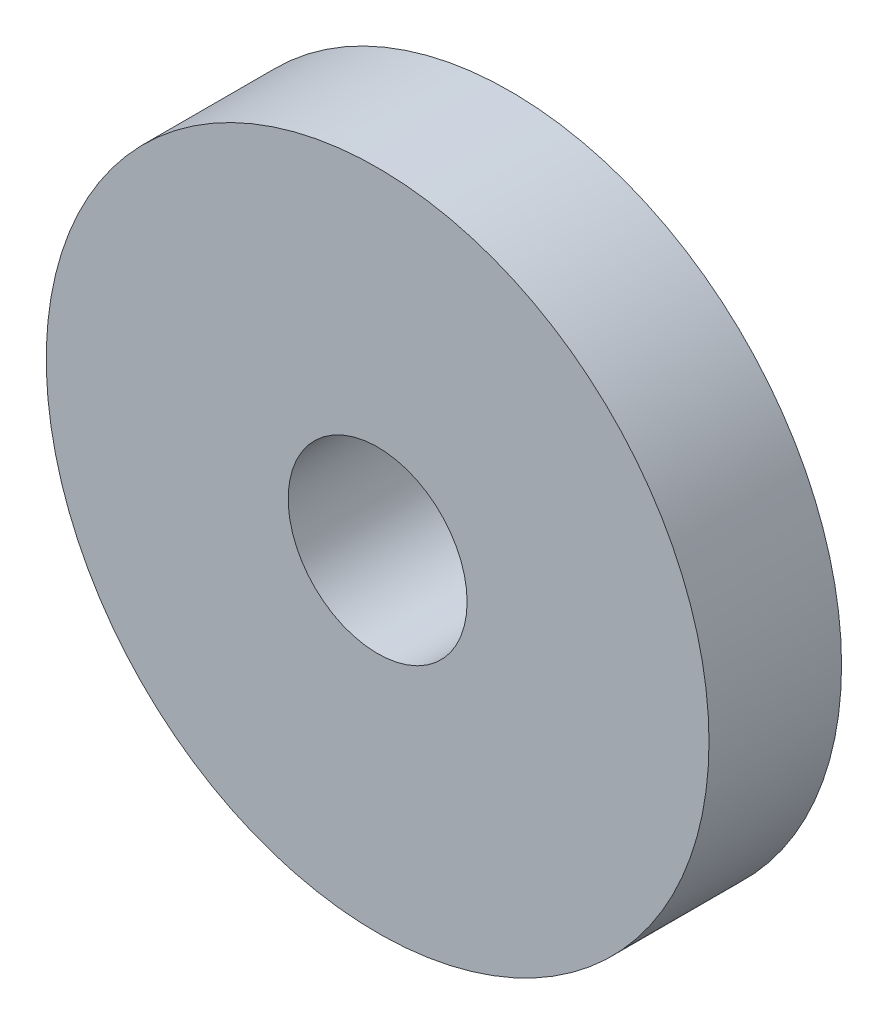
ISO-10303-21;
HEADER;
FILE_DESCRIPTION(('STEP AP214'),'2;1');
FILE_NAME('part.step','',(''),(''),'','','');
FILE_SCHEMA(('AUTOMOTIVE_DESIGN { 1 0 10303 214 1 1 1 1 }'));
ENDSEC;
DATA;
#1=APPLICATION_CONTEXT('core data for automotive mechanical design processes');
#2=APPLICATION_PROTOCOL_DEFINITION('international standard','automotive_design',2000,#1);
#3=PRODUCT_CONTEXT('',#1,'mechanical');
#4=PRODUCT('Part','Part','',(#3));
#5=PRODUCT_RELATED_PRODUCT_CATEGORY('part','',(#4));
#6=PRODUCT_DEFINITION_FORMATION('','',#4);
#7=PRODUCT_DEFINITION_CONTEXT('part definition',#1,'design');
#8=PRODUCT_DEFINITION('design','',#6,#7);
#9=PRODUCT_DEFINITION_SHAPE('','',#8);
#10=(LENGTH_UNIT() NAMED_UNIT(*) SI_UNIT(.MILLI.,.METRE.));
#11=(NAMED_UNIT(*) PLANE_ANGLE_UNIT() SI_UNIT($,.RADIAN.));
#12=(NAMED_UNIT(*) SI_UNIT($,.STERADIAN.) SOLID_ANGLE_UNIT());
#13=UNCERTAINTY_MEASURE_WITH_UNIT(LENGTH_MEASURE(1.E-05),#10,'distance_accuracy_value','');
#14=(GEOMETRIC_REPRESENTATION_CONTEXT(3) GLOBAL_UNCERTAINTY_ASSIGNED_CONTEXT((#13)) GLOBAL_UNIT_ASSIGNED_CONTEXT((#10,
#11,#12)) REPRESENTATION_CONTEXT('',''));
#15=CARTESIAN_POINT('',(0.,0.,0.));
#16=DIRECTION('',(0.,0.,1.));
#17=DIRECTION('',(1.,0.,0.));
#18=AXIS2_PLACEMENT_3D('',#15,#16,#17);
#19=CARTESIAN_POINT('',(0.,0.,2.));
#20=DIRECTION('',(0.,0.,1.));
#21=DIRECTION('',(1.,0.,0.));
#22=AXIS2_PLACEMENT_3D('',#19,#20,#21);
#23=PLANE('',#22);
#24=CARTESIAN_POINT('',(0.,0.,2.));
#25=DIRECTION('',(0.,0.,1.));
#26=DIRECTION('',(1.,0.,0.));
#27=AXIS2_PLACEMENT_3D('',#24,#25,#26);
#28=CIRCLE('',#27,4.99999999999989);
#29=CARTESIAN_POINT('',(4.99999999999989,0.,2.));
#30=VERTEX_POINT('',#29);
#31=EDGE_CURVE('E10',#30,#30,#28,.T.);
#32=ORIENTED_EDGE('',*,*,#31,.T.);
#33=EDGE_LOOP('',(#32));
#34=FACE_BOUND('',#33,.T.);
#35=CARTESIAN_POINT('',(0.,0.,2.));
#36=DIRECTION('',(0.,0.,1.));
#37=DIRECTION('',(1.,0.,0.));
#38=AXIS2_PLACEMENT_3D('',#35,#36,#37);
#39=CIRCLE('',#38,1.35);
#40=CARTESIAN_POINT('',(1.35,0.,2.));
#41=VERTEX_POINT('',#40);
#42=EDGE_CURVE('E41',#41,#41,#39,.T.);
#43=ORIENTED_EDGE('',*,*,#42,.F.);
#44=EDGE_LOOP('',(#43));
#45=FACE_BOUND('',#44,.T.);
#46=ADVANCED_FACE('F30',(#34,#45),#23,.T.);
#47=CARTESIAN_POINT('',(0.,0.,0.));
#48=DIRECTION('',(0.,0.,1.));
#49=DIRECTION('',(1.,0.,0.));
#50=AXIS2_PLACEMENT_3D('',#47,#48,#49);
#51=PLANE('',#50);
#52=CARTESIAN_POINT('',(0.,0.,0.));
#53=DIRECTION('',(0.,0.,1.));
#54=DIRECTION('',(1.,0.,0.));
#55=AXIS2_PLACEMENT_3D('',#52,#53,#54);
#56=CIRCLE('',#55,4.99999999999989);
#57=CARTESIAN_POINT('',(4.99999999999989,0.,0.));
#58=VERTEX_POINT('',#57);
#59=EDGE_CURVE('E34',#58,#58,#56,.T.);
#60=ORIENTED_EDGE('',*,*,#59,.F.);
#61=EDGE_LOOP('',(#60));
#62=FACE_BOUND('',#61,.T.);
#63=CARTESIAN_POINT('',(0.,0.,0.));
#64=DIRECTION('',(0.,0.,1.));
#65=DIRECTION('',(1.,0.,0.));
#66=AXIS2_PLACEMENT_3D('',#63,#64,#65);
#67=CIRCLE('',#66,1.35);
#68=CARTESIAN_POINT('',(1.35,0.,0.));
#69=VERTEX_POINT('',#68);
#70=EDGE_CURVE('E43',#69,#69,#67,.T.);
#71=ORIENTED_EDGE('',*,*,#70,.T.);
#72=EDGE_LOOP('',(#71));
#73=FACE_BOUND('',#72,.T.);
#74=ADVANCED_FACE('F53',(#62,#73),#51,.F.);
#75=CARTESIAN_POINT('',(0.,0.,2.));
#76=DIRECTION('',(0.,0.,-1.));
#77=DIRECTION('',(-1.,0.,0.));
#78=AXIS2_PLACEMENT_3D('',#75,#76,#77);
#79=CYLINDRICAL_SURFACE('',#78,4.99999999999989);
#80=ORIENTED_EDGE('',*,*,#31,.F.);
#81=EDGE_LOOP('',(#80));
#82=FACE_BOUND('',#81,.T.);
#83=ORIENTED_EDGE('',*,*,#59,.T.);
#84=EDGE_LOOP('',(#83));
#85=FACE_BOUND('',#84,.T.);
#86=ADVANCED_FACE('F32',(#82,#85),#79,.T.);
#87=CARTESIAN_POINT('',(0.,0.,2.));
#88=DIRECTION('',(0.,0.,-1.));
#89=DIRECTION('',(-1.,0.,0.));
#90=AXIS2_PLACEMENT_3D('',#87,#88,#89);
#91=CYLINDRICAL_SURFACE('',#90,1.35);
#92=ORIENTED_EDGE('',*,*,#42,.T.);
#93=EDGE_LOOP('',(#92));
#94=FACE_BOUND('',#93,.T.);
#95=ORIENTED_EDGE('',*,*,#70,.F.);
#96=EDGE_LOOP('',(#95));
#97=FACE_BOUND('',#96,.T.);
#98=ADVANCED_FACE('F49',(#94,#97),#91,.F.);
#99=CLOSED_SHELL('',(#46,#74,#86,#98));
#100=MANIFOLD_SOLID_BREP('B2',#99);
#101=ADVANCED_BREP_SHAPE_REPRESENTATION('',(#18,#100),#14);
#102=SHAPE_DEFINITION_REPRESENTATION(#9,#101);
ENDSEC;
END-ISO-10303-21;
